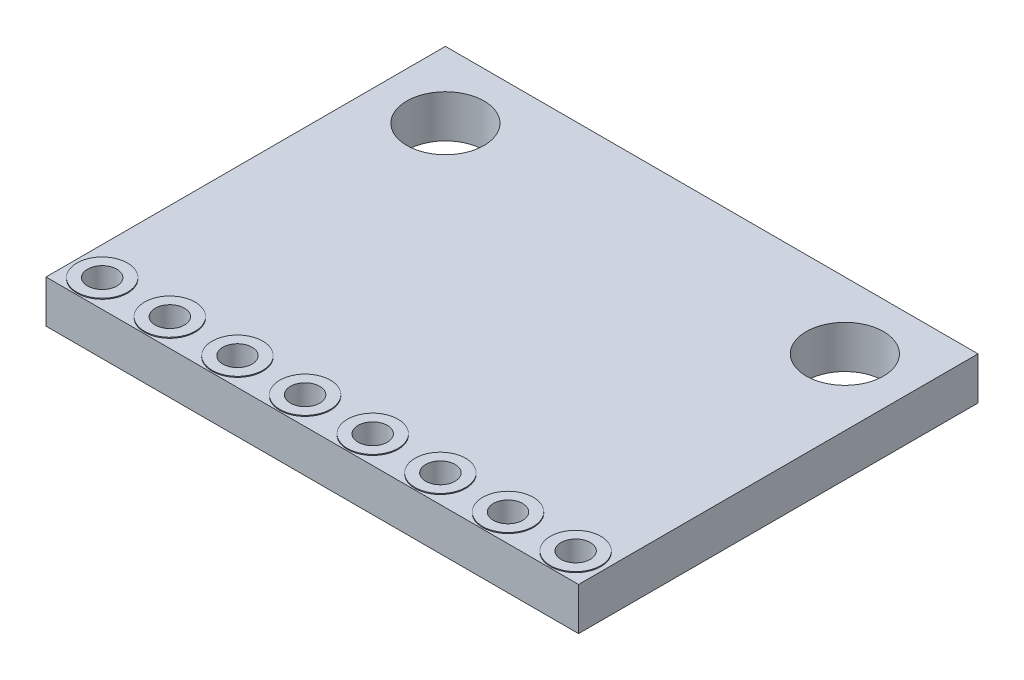
ISO-10303-21;
HEADER;
FILE_DESCRIPTION(('STEP AP214'),'2;1');
FILE_NAME('part.step','',(''),(''),'','','');
FILE_SCHEMA(('AUTOMOTIVE_DESIGN { 1 0 10303 214 1 1 1 1 }'));
ENDSEC;
DATA;
#1=APPLICATION_CONTEXT('core data for automotive mechanical design processes');
#2=APPLICATION_PROTOCOL_DEFINITION('international standard','automotive_design',2000,#1);
#3=PRODUCT_CONTEXT('',#1,'mechanical');
#4=PRODUCT('Part','Part','',(#3));
#5=PRODUCT_RELATED_PRODUCT_CATEGORY('part','',(#4));
#6=PRODUCT_DEFINITION_FORMATION('','',#4);
#7=PRODUCT_DEFINITION_CONTEXT('part definition',#1,'design');
#8=PRODUCT_DEFINITION('design','',#6,#7);
#9=PRODUCT_DEFINITION_SHAPE('','',#8);
#10=(LENGTH_UNIT() NAMED_UNIT(*) SI_UNIT(.MILLI.,.METRE.));
#11=(NAMED_UNIT(*) PLANE_ANGLE_UNIT() SI_UNIT($,.RADIAN.));
#12=(NAMED_UNIT(*) SI_UNIT($,.STERADIAN.) SOLID_ANGLE_UNIT());
#13=UNCERTAINTY_MEASURE_WITH_UNIT(LENGTH_MEASURE(1.E-05),#10,'distance_accuracy_value','');
#14=(GEOMETRIC_REPRESENTATION_CONTEXT(3) GLOBAL_UNCERTAINTY_ASSIGNED_CONTEXT((#13)) GLOBAL_UNIT_ASSIGNED_CONTEXT((#10,
#11,#12)) REPRESENTATION_CONTEXT('',''));
#15=CARTESIAN_POINT('',(0.,0.,0.));
#16=DIRECTION('',(0.,0.,1.));
#17=DIRECTION('',(1.,0.,0.));
#18=AXIS2_PLACEMENT_3D('',#15,#16,#17);
#19=CARTESIAN_POINT('',(0.,0.,0.));
#20=DIRECTION('',(0.,1.,0.));
#21=DIRECTION('',(0.,0.,1.));
#22=AXIS2_PLACEMENT_3D('',#19,#20,#21);
#23=PLANE('',#22);
#24=CARTESIAN_POINT('',(-6.35,0.,6.49999999999989));
#25=DIRECTION('',(0.,1.,0.));
#26=DIRECTION('',(0.,0.,1.));
#27=AXIS2_PLACEMENT_3D('',#24,#25,#26);
#28=CIRCLE('',#27,0.95);
#29=CARTESIAN_POINT('',(-6.35,0.,7.44999999999989));
#30=VERTEX_POINT('',#29);
#31=EDGE_CURVE('E41',#30,#30,#28,.F.);
#32=ORIENTED_EDGE('',*,*,#31,.F.);
#33=EDGE_LOOP('',(#32));
#34=FACE_BOUND('',#33,.T.);
#35=CARTESIAN_POINT('',(-1.27,0.,6.49999999999993));
#36=DIRECTION('',(0.,1.,0.));
#37=DIRECTION('',(0.,0.,1.));
#38=AXIS2_PLACEMENT_3D('',#35,#36,#37);
#39=CIRCLE('',#38,0.95);
#40=CARTESIAN_POINT('',(-1.27,0.,7.44999999999993));
#41=VERTEX_POINT('',#40);
#42=EDGE_CURVE('E123',#41,#41,#39,.F.);
#43=ORIENTED_EDGE('',*,*,#42,.F.);
#44=EDGE_LOOP('',(#43));
#45=FACE_BOUND('',#44,.T.);
#46=CARTESIAN_POINT('',(3.81,0.,6.49999999999996));
#47=DIRECTION('',(0.,1.,0.));
#48=DIRECTION('',(0.,0.,1.));
#49=AXIS2_PLACEMENT_3D('',#46,#47,#48);
#50=CIRCLE('',#49,0.95);
#51=CARTESIAN_POINT('',(3.81,0.,7.44999999999996));
#52=VERTEX_POINT('',#51);
#53=EDGE_CURVE('E117',#52,#52,#50,.F.);
#54=ORIENTED_EDGE('',*,*,#53,.F.);
#55=EDGE_LOOP('',(#54));
#56=FACE_BOUND('',#55,.T.);
#57=CARTESIAN_POINT('',(8.89,0.,6.5));
#58=DIRECTION('',(0.,1.,0.));
#59=DIRECTION('',(0.,0.,1.));
#60=AXIS2_PLACEMENT_3D('',#57,#58,#59);
#61=CIRCLE('',#60,0.95);
#62=CARTESIAN_POINT('',(8.89,0.,7.45));
#63=VERTEX_POINT('',#62);
#64=EDGE_CURVE('E111',#63,#63,#61,.F.);
#65=ORIENTED_EDGE('',*,*,#64,.F.);
#66=EDGE_LOOP('',(#65));
#67=FACE_BOUND('',#66,.T.);
#68=DIRECTION('',(0.,0.,-1.));
#69=VECTOR('',#68,1.);
#70=CARTESIAN_POINT('',(10.,0.,-7.5));
#71=LINE('',#70,#69);
#72=CARTESIAN_POINT('',(10.,0.,7.5));
#73=VERTEX_POINT('',#72);
#74=CARTESIAN_POINT('',(10.,0.,-7.5));
#75=VERTEX_POINT('',#74);
#76=EDGE_CURVE('E101',#73,#75,#71,.T.);
#77=ORIENTED_EDGE('',*,*,#76,.F.);
#78=DIRECTION('',(1.,0.,0.));
#79=VECTOR('',#78,1.);
#80=CARTESIAN_POINT('',(-10.,0.,7.5));
#81=LINE('',#80,#79);
#82=CARTESIAN_POINT('',(-10.,0.,7.5));
#83=VERTEX_POINT('',#82);
#84=EDGE_CURVE('E72',#83,#73,#81,.T.);
#85=ORIENTED_EDGE('',*,*,#84,.F.);
#86=DIRECTION('',(0.,0.,1.));
#87=VECTOR('',#86,1.);
#88=CARTESIAN_POINT('',(-10.,0.,-7.5));
#89=LINE('',#88,#87);
#90=CARTESIAN_POINT('',(-10.,0.,-7.5));
#91=VERTEX_POINT('',#90);
#92=EDGE_CURVE('E66',#91,#83,#89,.T.);
#93=ORIENTED_EDGE('',*,*,#92,.F.);
#94=DIRECTION('',(-1.,0.,0.));
#95=VECTOR('',#94,1.);
#96=CARTESIAN_POINT('',(-10.,0.,-7.5));
#97=LINE('',#96,#95);
#98=EDGE_CURVE('E91',#75,#91,#97,.T.);
#99=ORIENTED_EDGE('',*,*,#98,.F.);
#100=EDGE_LOOP('',(#77,#85,#93,#99));
#101=FACE_BOUND('',#100,.T.);
#102=CARTESIAN_POINT('',(-7.5,0.,-5.));
#103=DIRECTION('',(0.,1.,0.));
#104=DIRECTION('',(0.,0.,1.));
#105=AXIS2_PLACEMENT_3D('',#102,#103,#104);
#106=CIRCLE('',#105,1.45);
#107=CARTESIAN_POINT('',(-7.5,0.,-3.55));
#108=VERTEX_POINT('',#107);
#109=EDGE_CURVE('E147',#108,#108,#106,.T.);
#110=ORIENTED_EDGE('',*,*,#109,.T.);
#111=EDGE_LOOP('',(#110));
#112=FACE_BOUND('',#111,.T.);
#113=CARTESIAN_POINT('',(7.5,0.,-5.));
#114=DIRECTION('',(0.,1.,0.));
#115=DIRECTION('',(0.,0.,-1.));
#116=AXIS2_PLACEMENT_3D('',#113,#114,#115);
#117=CIRCLE('',#116,1.45);
#118=CARTESIAN_POINT('',(7.5,0.,-6.45));
#119=VERTEX_POINT('',#118);
#120=EDGE_CURVE('E151',#119,#119,#117,.T.);
#121=ORIENTED_EDGE('',*,*,#120,.T.);
#122=EDGE_LOOP('',(#121));
#123=FACE_BOUND('',#122,.T.);
#124=CARTESIAN_POINT('',(6.35,0.,6.49999999999998));
#125=DIRECTION('',(0.,1.,0.));
#126=DIRECTION('',(0.,0.,1.));
#127=AXIS2_PLACEMENT_3D('',#124,#125,#126);
#128=CIRCLE('',#127,0.95);
#129=CARTESIAN_POINT('',(6.35,0.,7.44999999999998));
#130=VERTEX_POINT('',#129);
#131=EDGE_CURVE('E114',#130,#130,#128,.F.);
#132=ORIENTED_EDGE('',*,*,#131,.F.);
#133=EDGE_LOOP('',(#132));
#134=FACE_BOUND('',#133,.T.);
#135=CARTESIAN_POINT('',(1.27,0.,6.49999999999995));
#136=DIRECTION('',(0.,1.,0.));
#137=DIRECTION('',(0.,0.,1.));
#138=AXIS2_PLACEMENT_3D('',#135,#136,#137);
#139=CIRCLE('',#138,0.95);
#140=CARTESIAN_POINT('',(1.27,0.,7.44999999999995));
#141=VERTEX_POINT('',#140);
#142=EDGE_CURVE('E120',#141,#141,#139,.F.);
#143=ORIENTED_EDGE('',*,*,#142,.F.);
#144=EDGE_LOOP('',(#143));
#145=FACE_BOUND('',#144,.T.);
#146=CARTESIAN_POINT('',(-3.81,0.,6.49999999999991));
#147=DIRECTION('',(0.,1.,0.));
#148=DIRECTION('',(0.,0.,1.));
#149=AXIS2_PLACEMENT_3D('',#146,#147,#148);
#150=CIRCLE('',#149,0.95);
#151=CARTESIAN_POINT('',(-3.81,0.,7.44999999999991));
#152=VERTEX_POINT('',#151);
#153=EDGE_CURVE('E126',#152,#152,#150,.F.);
#154=ORIENTED_EDGE('',*,*,#153,.F.);
#155=EDGE_LOOP('',(#154));
#156=FACE_BOUND('',#155,.T.);
#157=CARTESIAN_POINT('',(-8.89,0.,6.49999999999988));
#158=DIRECTION('',(0.,1.,0.));
#159=DIRECTION('',(0.,0.,1.));
#160=AXIS2_PLACEMENT_3D('',#157,#158,#159);
#161=CIRCLE('',#160,0.95);
#162=CARTESIAN_POINT('',(-8.89,0.,7.44999999999987));
#163=VERTEX_POINT('',#162);
#164=EDGE_CURVE('E11',#163,#163,#161,.F.);
#165=ORIENTED_EDGE('',*,*,#164,.F.);
#166=EDGE_LOOP('',(#165));
#167=FACE_BOUND('',#166,.T.);
#168=ADVANCED_FACE('F32',(#34,#45,#56,#67,#101,#112,#123,#134,#145,#156,#167),#23,.F.);
#169=CARTESIAN_POINT('',(0.,1.6,0.));
#170=DIRECTION('',(0.,1.,0.));
#171=DIRECTION('',(0.,0.,1.));
#172=AXIS2_PLACEMENT_3D('',#169,#170,#171);
#173=PLANE('',#172);
#174=CARTESIAN_POINT('',(8.89,1.6,6.50000000000005));
#175=DIRECTION('',(0.,1.,0.));
#176=DIRECTION('',(0.,0.,1.));
#177=AXIS2_PLACEMENT_3D('',#174,#175,#176);
#178=CIRCLE('',#177,0.949999999999999);
#179=CARTESIAN_POINT('',(8.89,1.6,7.45000000000005));
#180=VERTEX_POINT('',#179);
#181=EDGE_CURVE('E408',#180,#180,#178,.T.);
#182=ORIENTED_EDGE('',*,*,#181,.F.);
#183=EDGE_LOOP('',(#182));
#184=FACE_BOUND('',#183,.T.);
#185=CARTESIAN_POINT('',(3.81,1.6,6.50000000000005));
#186=DIRECTION('',(0.,1.,0.));
#187=DIRECTION('',(0.,0.,1.));
#188=AXIS2_PLACEMENT_3D('',#185,#186,#187);
#189=CIRCLE('',#188,0.949999999999999);
#190=CARTESIAN_POINT('',(3.81,1.6,7.45000000000005));
#191=VERTEX_POINT('',#190);
#192=EDGE_CURVE('E390',#191,#191,#189,.T.);
#193=ORIENTED_EDGE('',*,*,#192,.F.);
#194=EDGE_LOOP('',(#193));
#195=FACE_BOUND('',#194,.T.);
#196=CARTESIAN_POINT('',(-1.27,1.6,6.50000000000005));
#197=DIRECTION('',(0.,1.,0.));
#198=DIRECTION('',(0.,0.,1.));
#199=AXIS2_PLACEMENT_3D('',#196,#197,#198);
#200=CIRCLE('',#199,0.949999999999999);
#201=CARTESIAN_POINT('',(-1.27,1.6,7.45000000000005));
#202=VERTEX_POINT('',#201);
#203=EDGE_CURVE('E372',#202,#202,#200,.T.);
#204=ORIENTED_EDGE('',*,*,#203,.F.);
#205=EDGE_LOOP('',(#204));
#206=FACE_BOUND('',#205,.T.);
#207=CARTESIAN_POINT('',(-6.35,1.6,6.50000000000005));
#208=DIRECTION('',(0.,1.,0.));
#209=DIRECTION('',(0.,0.,1.));
#210=AXIS2_PLACEMENT_3D('',#207,#208,#209);
#211=CIRCLE('',#210,0.949999999999999);
#212=CARTESIAN_POINT('',(-6.35,1.6,7.45000000000005));
#213=VERTEX_POINT('',#212);
#214=EDGE_CURVE('E354',#213,#213,#211,.T.);
#215=ORIENTED_EDGE('',*,*,#214,.F.);
#216=EDGE_LOOP('',(#215));
#217=FACE_BOUND('',#216,.T.);
#218=CARTESIAN_POINT('',(-7.5,1.6,-5.));
#219=DIRECTION('',(0.,1.,0.));
#220=DIRECTION('',(0.,0.,1.));
#221=AXIS2_PLACEMENT_3D('',#218,#219,#220);
#222=CIRCLE('',#221,1.45);
#223=CARTESIAN_POINT('',(-7.5,1.6,-3.55));
#224=VERTEX_POINT('',#223);
#225=EDGE_CURVE('E104',#224,#224,#222,.T.);
#226=ORIENTED_EDGE('',*,*,#225,.F.);
#227=EDGE_LOOP('',(#226));
#228=FACE_BOUND('',#227,.T.);
#229=DIRECTION('',(0.,0.,-1.));
#230=VECTOR('',#229,1.);
#231=CARTESIAN_POINT('',(10.,1.6,-7.5));
#232=LINE('',#231,#230);
#233=CARTESIAN_POINT('',(10.,1.6,7.5));
#234=VERTEX_POINT('',#233);
#235=CARTESIAN_POINT('',(10.,1.6,-7.5));
#236=VERTEX_POINT('',#235);
#237=EDGE_CURVE('E86',#234,#236,#232,.T.);
#238=ORIENTED_EDGE('',*,*,#237,.T.);
#239=DIRECTION('',(-1.,0.,0.));
#240=VECTOR('',#239,1.);
#241=CARTESIAN_POINT('',(-10.,1.6,-7.5));
#242=LINE('',#241,#240);
#243=CARTESIAN_POINT('',(-10.,1.6,-7.5));
#244=VERTEX_POINT('',#243);
#245=EDGE_CURVE('E80',#236,#244,#242,.T.);
#246=ORIENTED_EDGE('',*,*,#245,.T.);
#247=DIRECTION('',(0.,0.,1.));
#248=VECTOR('',#247,1.);
#249=CARTESIAN_POINT('',(-10.,1.6,-7.5));
#250=LINE('',#249,#248);
#251=CARTESIAN_POINT('',(-10.,1.6,7.5));
#252=VERTEX_POINT('',#251);
#253=EDGE_CURVE('E84',#244,#252,#250,.T.);
#254=ORIENTED_EDGE('',*,*,#253,.T.);
#255=DIRECTION('',(1.,0.,0.));
#256=VECTOR('',#255,1.);
#257=CARTESIAN_POINT('',(-10.,1.6,7.5));
#258=LINE('',#257,#256);
#259=EDGE_CURVE('E49',#252,#234,#258,.T.);
#260=ORIENTED_EDGE('',*,*,#259,.T.);
#261=EDGE_LOOP('',(#238,#246,#254,#260));
#262=FACE_BOUND('',#261,.T.);
#263=CARTESIAN_POINT('',(7.5,1.6,-5.));
#264=DIRECTION('',(0.,1.,0.));
#265=DIRECTION('',(0.,0.,-1.));
#266=AXIS2_PLACEMENT_3D('',#263,#264,#265);
#267=CIRCLE('',#266,1.45);
#268=CARTESIAN_POINT('',(7.5,1.6,-6.45));
#269=VERTEX_POINT('',#268);
#270=EDGE_CURVE('E347',#269,#269,#267,.T.);
#271=ORIENTED_EDGE('',*,*,#270,.F.);
#272=EDGE_LOOP('',(#271));
#273=FACE_BOUND('',#272,.T.);
#274=CARTESIAN_POINT('',(-3.81,1.6,6.50000000000005));
#275=DIRECTION('',(0.,1.,0.));
#276=DIRECTION('',(0.,0.,1.));
#277=AXIS2_PLACEMENT_3D('',#274,#275,#276);
#278=CIRCLE('',#277,0.949999999999999);
#279=CARTESIAN_POINT('',(-3.81,1.6,7.45000000000005));
#280=VERTEX_POINT('',#279);
#281=EDGE_CURVE('E363',#280,#280,#278,.T.);
#282=ORIENTED_EDGE('',*,*,#281,.F.);
#283=EDGE_LOOP('',(#282));
#284=FACE_BOUND('',#283,.T.);
#285=CARTESIAN_POINT('',(1.27,1.6,6.50000000000005));
#286=DIRECTION('',(0.,1.,0.));
#287=DIRECTION('',(0.,0.,1.));
#288=AXIS2_PLACEMENT_3D('',#285,#286,#287);
#289=CIRCLE('',#288,0.949999999999999);
#290=CARTESIAN_POINT('',(1.27,1.6,7.45000000000005));
#291=VERTEX_POINT('',#290);
#292=EDGE_CURVE('E381',#291,#291,#289,.T.);
#293=ORIENTED_EDGE('',*,*,#292,.F.);
#294=EDGE_LOOP('',(#293));
#295=FACE_BOUND('',#294,.T.);
#296=CARTESIAN_POINT('',(6.35,1.6,6.50000000000005));
#297=DIRECTION('',(0.,1.,0.));
#298=DIRECTION('',(0.,0.,1.));
#299=AXIS2_PLACEMENT_3D('',#296,#297,#298);
#300=CIRCLE('',#299,0.949999999999999);
#301=CARTESIAN_POINT('',(6.35,1.6,7.45000000000005));
#302=VERTEX_POINT('',#301);
#303=EDGE_CURVE('E399',#302,#302,#300,.T.);
#304=ORIENTED_EDGE('',*,*,#303,.F.);
#305=EDGE_LOOP('',(#304));
#306=FACE_BOUND('',#305,.T.);
#307=CARTESIAN_POINT('',(-8.89,1.6,6.50000000000005));
#308=DIRECTION('',(0.,1.,0.));
#309=DIRECTION('',(0.,0.,1.));
#310=AXIS2_PLACEMENT_3D('',#307,#308,#309);
#311=CIRCLE('',#310,0.949999999999999);
#312=CARTESIAN_POINT('',(-8.89,1.6,7.45000000000005));
#313=VERTEX_POINT('',#312);
#314=EDGE_CURVE('E417',#313,#313,#311,.T.);
#315=ORIENTED_EDGE('',*,*,#314,.F.);
#316=EDGE_LOOP('',(#315));
#317=FACE_BOUND('',#316,.T.);
#318=ADVANCED_FACE('F81',(#184,#195,#206,#217,#228,#262,#273,#284,#295,#306,#317),#173,.T.);
#319=CARTESIAN_POINT('',(10.,1.6,-7.5));
#320=DIRECTION('',(-1.,0.,0.));
#321=DIRECTION('',(0.,0.,1.));
#322=AXIS2_PLACEMENT_3D('',#319,#320,#321);
#323=PLANE('',#322);
#324=ORIENTED_EDGE('',*,*,#76,.T.);
#325=DIRECTION('',(0.,-1.,0.));
#326=VECTOR('',#325,1.);
#327=CARTESIAN_POINT('',(10.,1.6,-7.5));
#328=LINE('',#327,#326);
#329=EDGE_CURVE('E92',#236,#75,#328,.T.);
#330=ORIENTED_EDGE('',*,*,#329,.F.);
#331=ORIENTED_EDGE('',*,*,#237,.F.);
#332=DIRECTION('',(0.,-1.,0.));
#333=VECTOR('',#332,1.);
#334=CARTESIAN_POINT('',(10.,1.6,7.5));
#335=LINE('',#334,#333);
#336=EDGE_CURVE('E97',#234,#73,#335,.T.);
#337=ORIENTED_EDGE('',*,*,#336,.T.);
#338=EDGE_LOOP('',(#324,#330,#331,#337));
#339=FACE_BOUND('',#338,.T.);
#340=ADVANCED_FACE('F34',(#339),#323,.F.);
#341=CARTESIAN_POINT('',(-10.,1.6,-7.5));
#342=DIRECTION('',(0.,0.,1.));
#343=DIRECTION('',(1.,0.,0.));
#344=AXIS2_PLACEMENT_3D('',#341,#342,#343);
#345=PLANE('',#344);
#346=ORIENTED_EDGE('',*,*,#98,.T.);
#347=DIRECTION('',(0.,-1.,0.));
#348=VECTOR('',#347,1.);
#349=CARTESIAN_POINT('',(-10.,1.6,-7.5));
#350=LINE('',#349,#348);
#351=EDGE_CURVE('E89',#244,#91,#350,.T.);
#352=ORIENTED_EDGE('',*,*,#351,.F.);
#353=ORIENTED_EDGE('',*,*,#245,.F.);
#354=ORIENTED_EDGE('',*,*,#329,.T.);
#355=EDGE_LOOP('',(#346,#352,#353,#354));
#356=FACE_BOUND('',#355,.T.);
#357=ADVANCED_FACE('F90',(#356),#345,.F.);
#358=CARTESIAN_POINT('',(-10.,1.6,-7.5));
#359=DIRECTION('',(1.,0.,0.));
#360=DIRECTION('',(0.,0.,-1.));
#361=AXIS2_PLACEMENT_3D('',#358,#359,#360);
#362=PLANE('',#361);
#363=ORIENTED_EDGE('',*,*,#92,.T.);
#364=DIRECTION('',(0.,-1.,0.));
#365=VECTOR('',#364,1.);
#366=CARTESIAN_POINT('',(-10.,1.6,7.5));
#367=LINE('',#366,#365);
#368=EDGE_CURVE('E93',#252,#83,#367,.T.);
#369=ORIENTED_EDGE('',*,*,#368,.F.);
#370=ORIENTED_EDGE('',*,*,#253,.F.);
#371=ORIENTED_EDGE('',*,*,#351,.T.);
#372=EDGE_LOOP('',(#363,#369,#370,#371));
#373=FACE_BOUND('',#372,.T.);
#374=ADVANCED_FACE('F95',(#373),#362,.F.);
#375=CARTESIAN_POINT('',(-10.,1.6,7.5));
#376=DIRECTION('',(0.,0.,-1.));
#377=DIRECTION('',(-1.,0.,0.));
#378=AXIS2_PLACEMENT_3D('',#375,#376,#377);
#379=PLANE('',#378);
#380=ORIENTED_EDGE('',*,*,#84,.T.);
#381=ORIENTED_EDGE('',*,*,#336,.F.);
#382=ORIENTED_EDGE('',*,*,#259,.F.);
#383=ORIENTED_EDGE('',*,*,#368,.T.);
#384=EDGE_LOOP('',(#380,#381,#382,#383));
#385=FACE_BOUND('',#384,.T.);
#386=ADVANCED_FACE('F330',(#385),#379,.F.);
#387=CARTESIAN_POINT('',(-7.5,1.6,-5.));
#388=DIRECTION('',(0.,-1.,0.));
#389=DIRECTION('',(0.,0.,-1.));
#390=AXIS2_PLACEMENT_3D('',#387,#388,#389);
#391=CYLINDRICAL_SURFACE('',#390,1.45);
#392=ORIENTED_EDGE('',*,*,#225,.T.);
#393=EDGE_LOOP('',(#392));
#394=FACE_BOUND('',#393,.T.);
#395=ORIENTED_EDGE('',*,*,#109,.F.);
#396=EDGE_LOOP('',(#395));
#397=FACE_BOUND('',#396,.T.);
#398=ADVANCED_FACE('F326',(#394,#397),#391,.F.);
#399=CARTESIAN_POINT('',(7.5,1.6,-5.));
#400=DIRECTION('',(0.,-1.,0.));
#401=DIRECTION('',(0.,0.,-1.));
#402=AXIS2_PLACEMENT_3D('',#399,#400,#401);
#403=CYLINDRICAL_SURFACE('',#402,1.45);
#404=ORIENTED_EDGE('',*,*,#270,.T.);
#405=EDGE_LOOP('',(#404));
#406=FACE_BOUND('',#405,.T.);
#407=ORIENTED_EDGE('',*,*,#120,.F.);
#408=EDGE_LOOP('',(#407));
#409=FACE_BOUND('',#408,.T.);
#410=ADVANCED_FACE('F322',(#406,#409),#403,.F.);
#411=CARTESIAN_POINT('',(-1.27,1.6,6.5));
#412=DIRECTION('',(0.,-1.,0.));
#413=DIRECTION('',(0.,0.,-1.));
#414=AXIS2_PLACEMENT_3D('',#411,#412,#413);
#415=CYLINDRICAL_SURFACE('',#414,0.55);
#416=CARTESIAN_POINT('',(-1.27,1.635,6.50000000000005));
#417=DIRECTION('',(0.,1.,0.));
#418=DIRECTION('',(0.,0.,1.));
#419=AXIS2_PLACEMENT_3D('',#416,#417,#418);
#420=CIRCLE('',#419,0.55);
#421=CARTESIAN_POINT('',(-1.27,1.635,7.05000000000005));
#422=VERTEX_POINT('',#421);
#423=EDGE_CURVE('E375',#422,#422,#420,.T.);
#424=ORIENTED_EDGE('',*,*,#423,.T.);
#425=EDGE_LOOP('',(#424));
#426=FACE_BOUND('',#425,.T.);
#427=CARTESIAN_POINT('',(-1.27,-0.035,6.49999999999993));
#428=DIRECTION('',(0.,-1.,0.));
#429=DIRECTION('',(0.,0.,-1.));
#430=AXIS2_PLACEMENT_3D('',#427,#428,#429);
#431=CIRCLE('',#430,0.55);
#432=CARTESIAN_POINT('',(-1.27,-0.035,5.94999999999993));
#433=VERTEX_POINT('',#432);
#434=EDGE_CURVE('E452',#433,#433,#431,.T.);
#435=ORIENTED_EDGE('',*,*,#434,.T.);
#436=EDGE_LOOP('',(#435));
#437=FACE_BOUND('',#436,.T.);
#438=ADVANCED_FACE('F318',(#426,#437),#415,.F.);
#439=CARTESIAN_POINT('',(-3.81,1.6,6.50000000000002));
#440=DIRECTION('',(0.,-1.,0.));
#441=DIRECTION('',(0.,0.,-1.));
#442=AXIS2_PLACEMENT_3D('',#439,#440,#441);
#443=CYLINDRICAL_SURFACE('',#442,0.55);
#444=CARTESIAN_POINT('',(-3.81,1.635,6.50000000000005));
#445=DIRECTION('',(0.,1.,0.));
#446=DIRECTION('',(0.,0.,1.));
#447=AXIS2_PLACEMENT_3D('',#444,#445,#446);
#448=CIRCLE('',#447,0.55);
#449=CARTESIAN_POINT('',(-3.81,1.635,7.05000000000005));
#450=VERTEX_POINT('',#449);
#451=EDGE_CURVE('E366',#450,#450,#448,.T.);
#452=ORIENTED_EDGE('',*,*,#451,.T.);
#453=EDGE_LOOP('',(#452));
#454=FACE_BOUND('',#453,.T.);
#455=CARTESIAN_POINT('',(-3.81,-0.035,6.49999999999991));
#456=DIRECTION('',(0.,-1.,0.));
#457=DIRECTION('',(0.,0.,-1.));
#458=AXIS2_PLACEMENT_3D('',#455,#456,#457);
#459=CIRCLE('',#458,0.55);
#460=CARTESIAN_POINT('',(-3.81,-0.035,5.94999999999991));
#461=VERTEX_POINT('',#460);
#462=EDGE_CURVE('E458',#461,#461,#459,.T.);
#463=ORIENTED_EDGE('',*,*,#462,.T.);
#464=EDGE_LOOP('',(#463));
#465=FACE_BOUND('',#464,.T.);
#466=ADVANCED_FACE('F314',(#454,#465),#443,.F.);
#467=CARTESIAN_POINT('',(-6.35,1.6,6.50000000000004));
#468=DIRECTION('',(0.,-1.,0.));
#469=DIRECTION('',(0.,0.,-1.));
#470=AXIS2_PLACEMENT_3D('',#467,#468,#469);
#471=CYLINDRICAL_SURFACE('',#470,0.55);
#472=CARTESIAN_POINT('',(-6.35,1.635,6.50000000000005));
#473=DIRECTION('',(0.,1.,0.));
#474=DIRECTION('',(0.,0.,1.));
#475=AXIS2_PLACEMENT_3D('',#472,#473,#474);
#476=CIRCLE('',#475,0.55);
#477=CARTESIAN_POINT('',(-6.35,1.635,7.05000000000005));
#478=VERTEX_POINT('',#477);
#479=EDGE_CURVE('E357',#478,#478,#476,.T.);
#480=ORIENTED_EDGE('',*,*,#479,.T.);
#481=EDGE_LOOP('',(#480));
#482=FACE_BOUND('',#481,.T.);
#483=CARTESIAN_POINT('',(-6.35,-0.035,6.49999999999989));
#484=DIRECTION('',(0.,-1.,0.));
#485=DIRECTION('',(0.,0.,-1.));
#486=AXIS2_PLACEMENT_3D('',#483,#484,#485);
#487=CIRCLE('',#486,0.55);
#488=CARTESIAN_POINT('',(-6.35,-0.035,5.94999999999989));
#489=VERTEX_POINT('',#488);
#490=EDGE_CURVE('E464',#489,#489,#487,.T.);
#491=ORIENTED_EDGE('',*,*,#490,.T.);
#492=EDGE_LOOP('',(#491));
#493=FACE_BOUND('',#492,.T.);
#494=ADVANCED_FACE('F310',(#482,#493),#471,.F.);
#495=CARTESIAN_POINT('',(-8.89,1.6,6.50000000000005));
#496=DIRECTION('',(0.,-1.,0.));
#497=DIRECTION('',(0.,0.,-1.));
#498=AXIS2_PLACEMENT_3D('',#495,#496,#497);
#499=CYLINDRICAL_SURFACE('',#498,0.55);
#500=CARTESIAN_POINT('',(-8.89,1.635,6.50000000000005));
#501=DIRECTION('',(0.,1.,0.));
#502=DIRECTION('',(0.,0.,1.));
#503=AXIS2_PLACEMENT_3D('',#500,#501,#502);
#504=CIRCLE('',#503,0.55);
#505=CARTESIAN_POINT('',(-8.89,1.635,7.05000000000005));
#506=VERTEX_POINT('',#505);
#507=EDGE_CURVE('E420',#506,#506,#504,.T.);
#508=ORIENTED_EDGE('',*,*,#507,.T.);
#509=EDGE_LOOP('',(#508));
#510=FACE_BOUND('',#509,.T.);
#511=CARTESIAN_POINT('',(-8.89,-0.035,6.49999999999988));
#512=DIRECTION('',(0.,-1.,0.));
#513=DIRECTION('',(0.,0.,-1.));
#514=AXIS2_PLACEMENT_3D('',#511,#512,#513);
#515=CIRCLE('',#514,0.55);
#516=CARTESIAN_POINT('',(-8.89,-0.035,5.94999999999988));
#517=VERTEX_POINT('',#516);
#518=EDGE_CURVE('E470',#517,#517,#515,.T.);
#519=ORIENTED_EDGE('',*,*,#518,.T.);
#520=EDGE_LOOP('',(#519));
#521=FACE_BOUND('',#520,.T.);
#522=ADVANCED_FACE('F306',(#510,#521),#499,.F.);
#523=CARTESIAN_POINT('',(1.27,1.6,6.5));
#524=DIRECTION('',(0.,-1.,0.));
#525=DIRECTION('',(0.,0.,-1.));
#526=AXIS2_PLACEMENT_3D('',#523,#524,#525);
#527=CYLINDRICAL_SURFACE('',#526,0.55);
#528=CARTESIAN_POINT('',(1.27,1.635,6.50000000000005));
#529=DIRECTION('',(0.,1.,0.));
#530=DIRECTION('',(0.,0.,1.));
#531=AXIS2_PLACEMENT_3D('',#528,#529,#530);
#532=CIRCLE('',#531,0.55);
#533=CARTESIAN_POINT('',(1.27,1.635,7.05000000000005));
#534=VERTEX_POINT('',#533);
#535=EDGE_CURVE('E384',#534,#534,#532,.T.);
#536=ORIENTED_EDGE('',*,*,#535,.T.);
#537=EDGE_LOOP('',(#536));
#538=FACE_BOUND('',#537,.T.);
#539=CARTESIAN_POINT('',(1.27,-0.035,6.49999999999995));
#540=DIRECTION('',(0.,-1.,0.));
#541=DIRECTION('',(0.,0.,-1.));
#542=AXIS2_PLACEMENT_3D('',#539,#540,#541);
#543=CIRCLE('',#542,0.55);
#544=CARTESIAN_POINT('',(1.27,-0.035,5.94999999999995));
#545=VERTEX_POINT('',#544);
#546=EDGE_CURVE('E446',#545,#545,#543,.T.);
#547=ORIENTED_EDGE('',*,*,#546,.T.);
#548=EDGE_LOOP('',(#547));
#549=FACE_BOUND('',#548,.T.);
#550=ADVANCED_FACE('F302',(#538,#549),#527,.F.);
#551=CARTESIAN_POINT('',(3.81,1.6,6.5));
#552=DIRECTION('',(0.,-1.,0.));
#553=DIRECTION('',(0.,0.,-1.));
#554=AXIS2_PLACEMENT_3D('',#551,#552,#553);
#555=CYLINDRICAL_SURFACE('',#554,0.55);
#556=CARTESIAN_POINT('',(3.81,1.635,6.50000000000005));
#557=DIRECTION('',(0.,1.,0.));
#558=DIRECTION('',(0.,0.,1.));
#559=AXIS2_PLACEMENT_3D('',#556,#557,#558);
#560=CIRCLE('',#559,0.55);
#561=CARTESIAN_POINT('',(3.81,1.635,7.05000000000005));
#562=VERTEX_POINT('',#561);
#563=EDGE_CURVE('E393',#562,#562,#560,.T.);
#564=ORIENTED_EDGE('',*,*,#563,.T.);
#565=EDGE_LOOP('',(#564));
#566=FACE_BOUND('',#565,.T.);
#567=CARTESIAN_POINT('',(3.81,-0.035,6.49999999999996));
#568=DIRECTION('',(0.,-1.,0.));
#569=DIRECTION('',(0.,0.,-1.));
#570=AXIS2_PLACEMENT_3D('',#567,#568,#569);
#571=CIRCLE('',#570,0.55);
#572=CARTESIAN_POINT('',(3.81,-0.035,5.94999999999996));
#573=VERTEX_POINT('',#572);
#574=EDGE_CURVE('E440',#573,#573,#571,.T.);
#575=ORIENTED_EDGE('',*,*,#574,.T.);
#576=EDGE_LOOP('',(#575));
#577=FACE_BOUND('',#576,.T.);
#578=ADVANCED_FACE('F298',(#566,#577),#555,.F.);
#579=CARTESIAN_POINT('',(6.35,1.6,6.5));
#580=DIRECTION('',(0.,-1.,0.));
#581=DIRECTION('',(0.,0.,-1.));
#582=AXIS2_PLACEMENT_3D('',#579,#580,#581);
#583=CYLINDRICAL_SURFACE('',#582,0.55);
#584=CARTESIAN_POINT('',(6.35,1.635,6.50000000000005));
#585=DIRECTION('',(0.,1.,0.));
#586=DIRECTION('',(0.,0.,1.));
#587=AXIS2_PLACEMENT_3D('',#584,#585,#586);
#588=CIRCLE('',#587,0.55);
#589=CARTESIAN_POINT('',(6.35,1.635,7.05000000000005));
#590=VERTEX_POINT('',#589);
#591=EDGE_CURVE('E402',#590,#590,#588,.T.);
#592=ORIENTED_EDGE('',*,*,#591,.T.);
#593=EDGE_LOOP('',(#592));
#594=FACE_BOUND('',#593,.T.);
#595=CARTESIAN_POINT('',(6.35,-0.035,6.49999999999998));
#596=DIRECTION('',(0.,-1.,0.));
#597=DIRECTION('',(0.,0.,-1.));
#598=AXIS2_PLACEMENT_3D('',#595,#596,#597);
#599=CIRCLE('',#598,0.55);
#600=CARTESIAN_POINT('',(6.35,-0.035,5.94999999999998));
#601=VERTEX_POINT('',#600);
#602=EDGE_CURVE('E434',#601,#601,#599,.T.);
#603=ORIENTED_EDGE('',*,*,#602,.T.);
#604=EDGE_LOOP('',(#603));
#605=FACE_BOUND('',#604,.T.);
#606=ADVANCED_FACE('F294',(#594,#605),#583,.F.);
#607=CARTESIAN_POINT('',(8.89,1.6,6.5));
#608=DIRECTION('',(0.,-1.,0.));
#609=DIRECTION('',(0.,0.,-1.));
#610=AXIS2_PLACEMENT_3D('',#607,#608,#609);
#611=CYLINDRICAL_SURFACE('',#610,0.55);
#612=CARTESIAN_POINT('',(8.89,1.635,6.50000000000005));
#613=DIRECTION('',(0.,1.,0.));
#614=DIRECTION('',(0.,0.,1.));
#615=AXIS2_PLACEMENT_3D('',#612,#613,#614);
#616=CIRCLE('',#615,0.55);
#617=CARTESIAN_POINT('',(8.89,1.635,7.05000000000005));
#618=VERTEX_POINT('',#617);
#619=EDGE_CURVE('E411',#618,#618,#616,.T.);
#620=ORIENTED_EDGE('',*,*,#619,.T.);
#621=EDGE_LOOP('',(#620));
#622=FACE_BOUND('',#621,.T.);
#623=CARTESIAN_POINT('',(8.89,-0.035,6.5));
#624=DIRECTION('',(0.,-1.,0.));
#625=DIRECTION('',(0.,0.,-1.));
#626=AXIS2_PLACEMENT_3D('',#623,#624,#625);
#627=CIRCLE('',#626,0.55);
#628=CARTESIAN_POINT('',(8.89,-0.035,5.95));
#629=VERTEX_POINT('',#628);
#630=EDGE_CURVE('E428',#629,#629,#627,.T.);
#631=ORIENTED_EDGE('',*,*,#630,.T.);
#632=EDGE_LOOP('',(#631));
#633=FACE_BOUND('',#632,.T.);
#634=ADVANCED_FACE('F287',(#622,#633),#611,.F.);
#635=CARTESIAN_POINT('',(-6.35,1.635,6.50000000000005));
#636=DIRECTION('',(0.,1.,0.));
#637=DIRECTION('',(0.,0.,1.));
#638=AXIS2_PLACEMENT_3D('',#635,#636,#637);
#639=PLANE('',#638);
#640=CARTESIAN_POINT('',(-6.35,1.635,6.50000000000005));
#641=DIRECTION('',(0.,1.,0.));
#642=DIRECTION('',(0.,0.,1.));
#643=AXIS2_PLACEMENT_3D('',#640,#641,#642);
#644=CIRCLE('',#643,0.949999999999999);
#645=CARTESIAN_POINT('',(-6.35,1.635,7.45000000000005));
#646=VERTEX_POINT('',#645);
#647=EDGE_CURVE('E351',#646,#646,#644,.T.);
#648=ORIENTED_EDGE('',*,*,#647,.T.);
#649=EDGE_LOOP('',(#648));
#650=FACE_BOUND('',#649,.T.);
#651=ORIENTED_EDGE('',*,*,#479,.F.);
#652=EDGE_LOOP('',(#651));
#653=FACE_BOUND('',#652,.T.);
#654=ADVANCED_FACE('F284',(#650,#653),#639,.T.);
#655=CARTESIAN_POINT('',(-6.35,1.635,6.50000000000005));
#656=DIRECTION('',(0.,-1.,0.));
#657=DIRECTION('',(0.,0.,-1.));
#658=AXIS2_PLACEMENT_3D('',#655,#656,#657);
#659=CYLINDRICAL_SURFACE('',#658,0.949999999999999);
#660=ORIENTED_EDGE('',*,*,#647,.F.);
#661=EDGE_LOOP('',(#660));
#662=FACE_BOUND('',#661,.T.);
#663=ORIENTED_EDGE('',*,*,#214,.T.);
#664=EDGE_LOOP('',(#663));
#665=FACE_BOUND('',#664,.T.);
#666=ADVANCED_FACE('F279',(#662,#665),#659,.T.);
#667=CARTESIAN_POINT('',(-3.81,1.635,6.50000000000005));
#668=DIRECTION('',(0.,1.,0.));
#669=DIRECTION('',(0.,0.,1.));
#670=AXIS2_PLACEMENT_3D('',#667,#668,#669);
#671=PLANE('',#670);
#672=CARTESIAN_POINT('',(-3.81,1.635,6.50000000000005));
#673=DIRECTION('',(0.,1.,0.));
#674=DIRECTION('',(0.,0.,1.));
#675=AXIS2_PLACEMENT_3D('',#672,#673,#674);
#676=CIRCLE('',#675,0.949999999999999);
#677=CARTESIAN_POINT('',(-3.81,1.635,7.45000000000005));
#678=VERTEX_POINT('',#677);
#679=EDGE_CURVE('E362',#678,#678,#676,.T.);
#680=ORIENTED_EDGE('',*,*,#679,.T.);
#681=EDGE_LOOP('',(#680));
#682=FACE_BOUND('',#681,.T.);
#683=ORIENTED_EDGE('',*,*,#451,.F.);
#684=EDGE_LOOP('',(#683));
#685=FACE_BOUND('',#684,.T.);
#686=ADVANCED_FACE('F276',(#682,#685),#671,.T.);
#687=CARTESIAN_POINT('',(-3.81,1.635,6.50000000000005));
#688=DIRECTION('',(0.,-1.,0.));
#689=DIRECTION('',(0.,0.,-1.));
#690=AXIS2_PLACEMENT_3D('',#687,#688,#689);
#691=CYLINDRICAL_SURFACE('',#690,0.949999999999999);
#692=ORIENTED_EDGE('',*,*,#679,.F.);
#693=EDGE_LOOP('',(#692));
#694=FACE_BOUND('',#693,.T.);
#695=ORIENTED_EDGE('',*,*,#281,.T.);
#696=EDGE_LOOP('',(#695));
#697=FACE_BOUND('',#696,.T.);
#698=ADVANCED_FACE('F271',(#694,#697),#691,.T.);
#699=CARTESIAN_POINT('',(-1.27,1.635,6.50000000000005));
#700=DIRECTION('',(0.,1.,0.));
#701=DIRECTION('',(0.,0.,1.));
#702=AXIS2_PLACEMENT_3D('',#699,#700,#701);
#703=PLANE('',#702);
#704=CARTESIAN_POINT('',(-1.27,1.635,6.50000000000005));
#705=DIRECTION('',(0.,1.,0.));
#706=DIRECTION('',(0.,0.,1.));
#707=AXIS2_PLACEMENT_3D('',#704,#705,#706);
#708=CIRCLE('',#707,0.949999999999999);
#709=CARTESIAN_POINT('',(-1.27,1.635,7.45000000000005));
#710=VERTEX_POINT('',#709);
#711=EDGE_CURVE('E371',#710,#710,#708,.T.);
#712=ORIENTED_EDGE('',*,*,#711,.T.);
#713=EDGE_LOOP('',(#712));
#714=FACE_BOUND('',#713,.T.);
#715=ORIENTED_EDGE('',*,*,#423,.F.);
#716=EDGE_LOOP('',(#715));
#717=FACE_BOUND('',#716,.T.);
#718=ADVANCED_FACE('F268',(#714,#717),#703,.T.);
#719=CARTESIAN_POINT('',(-1.27,1.635,6.50000000000005));
#720=DIRECTION('',(0.,-1.,0.));
#721=DIRECTION('',(0.,0.,-1.));
#722=AXIS2_PLACEMENT_3D('',#719,#720,#721);
#723=CYLINDRICAL_SURFACE('',#722,0.949999999999999);
#724=ORIENTED_EDGE('',*,*,#711,.F.);
#725=EDGE_LOOP('',(#724));
#726=FACE_BOUND('',#725,.T.);
#727=ORIENTED_EDGE('',*,*,#203,.T.);
#728=EDGE_LOOP('',(#727));
#729=FACE_BOUND('',#728,.T.);
#730=ADVANCED_FACE('F263',(#726,#729),#723,.T.);
#731=CARTESIAN_POINT('',(1.27,1.635,6.50000000000005));
#732=DIRECTION('',(0.,1.,0.));
#733=DIRECTION('',(0.,0.,1.));
#734=AXIS2_PLACEMENT_3D('',#731,#732,#733);
#735=PLANE('',#734);
#736=CARTESIAN_POINT('',(1.27,1.635,6.50000000000005));
#737=DIRECTION('',(0.,1.,0.));
#738=DIRECTION('',(0.,0.,1.));
#739=AXIS2_PLACEMENT_3D('',#736,#737,#738);
#740=CIRCLE('',#739,0.949999999999999);
#741=CARTESIAN_POINT('',(1.27,1.635,7.45000000000005));
#742=VERTEX_POINT('',#741);
#743=EDGE_CURVE('E380',#742,#742,#740,.T.);
#744=ORIENTED_EDGE('',*,*,#743,.T.);
#745=EDGE_LOOP('',(#744));
#746=FACE_BOUND('',#745,.T.);
#747=ORIENTED_EDGE('',*,*,#535,.F.);
#748=EDGE_LOOP('',(#747));
#749=FACE_BOUND('',#748,.T.);
#750=ADVANCED_FACE('F260',(#746,#749),#735,.T.);
#751=CARTESIAN_POINT('',(1.27,1.635,6.50000000000005));
#752=DIRECTION('',(0.,-1.,0.));
#753=DIRECTION('',(0.,0.,-1.));
#754=AXIS2_PLACEMENT_3D('',#751,#752,#753);
#755=CYLINDRICAL_SURFACE('',#754,0.949999999999999);
#756=ORIENTED_EDGE('',*,*,#743,.F.);
#757=EDGE_LOOP('',(#756));
#758=FACE_BOUND('',#757,.T.);
#759=ORIENTED_EDGE('',*,*,#292,.T.);
#760=EDGE_LOOP('',(#759));
#761=FACE_BOUND('',#760,.T.);
#762=ADVANCED_FACE('F255',(#758,#761),#755,.T.);
#763=CARTESIAN_POINT('',(3.81,1.635,6.50000000000005));
#764=DIRECTION('',(0.,1.,0.));
#765=DIRECTION('',(0.,0.,1.));
#766=AXIS2_PLACEMENT_3D('',#763,#764,#765);
#767=PLANE('',#766);
#768=CARTESIAN_POINT('',(3.81,1.635,6.50000000000005));
#769=DIRECTION('',(0.,1.,0.));
#770=DIRECTION('',(0.,0.,1.));
#771=AXIS2_PLACEMENT_3D('',#768,#769,#770);
#772=CIRCLE('',#771,0.949999999999999);
#773=CARTESIAN_POINT('',(3.81,1.635,7.45000000000005));
#774=VERTEX_POINT('',#773);
#775=EDGE_CURVE('E389',#774,#774,#772,.T.);
#776=ORIENTED_EDGE('',*,*,#775,.T.);
#777=EDGE_LOOP('',(#776));
#778=FACE_BOUND('',#777,.T.);
#779=ORIENTED_EDGE('',*,*,#563,.F.);
#780=EDGE_LOOP('',(#779));
#781=FACE_BOUND('',#780,.T.);
#782=ADVANCED_FACE('F252',(#778,#781),#767,.T.);
#783=CARTESIAN_POINT('',(3.81,1.635,6.50000000000005));
#784=DIRECTION('',(0.,-1.,0.));
#785=DIRECTION('',(0.,0.,-1.));
#786=AXIS2_PLACEMENT_3D('',#783,#784,#785);
#787=CYLINDRICAL_SURFACE('',#786,0.949999999999999);
#788=ORIENTED_EDGE('',*,*,#775,.F.);
#789=EDGE_LOOP('',(#788));
#790=FACE_BOUND('',#789,.T.);
#791=ORIENTED_EDGE('',*,*,#192,.T.);
#792=EDGE_LOOP('',(#791));
#793=FACE_BOUND('',#792,.T.);
#794=ADVANCED_FACE('F247',(#790,#793),#787,.T.);
#795=CARTESIAN_POINT('',(6.35,1.635,6.50000000000005));
#796=DIRECTION('',(0.,1.,0.));
#797=DIRECTION('',(0.,0.,1.));
#798=AXIS2_PLACEMENT_3D('',#795,#796,#797);
#799=PLANE('',#798);
#800=CARTESIAN_POINT('',(6.35,1.635,6.50000000000005));
#801=DIRECTION('',(0.,1.,0.));
#802=DIRECTION('',(0.,0.,1.));
#803=AXIS2_PLACEMENT_3D('',#800,#801,#802);
#804=CIRCLE('',#803,0.949999999999999);
#805=CARTESIAN_POINT('',(6.35,1.635,7.45000000000005));
#806=VERTEX_POINT('',#805);
#807=EDGE_CURVE('E398',#806,#806,#804,.T.);
#808=ORIENTED_EDGE('',*,*,#807,.T.);
#809=EDGE_LOOP('',(#808));
#810=FACE_BOUND('',#809,.T.);
#811=ORIENTED_EDGE('',*,*,#591,.F.);
#812=EDGE_LOOP('',(#811));
#813=FACE_BOUND('',#812,.T.);
#814=ADVANCED_FACE('F244',(#810,#813),#799,.T.);
#815=CARTESIAN_POINT('',(6.35,1.635,6.50000000000005));
#816=DIRECTION('',(0.,-1.,0.));
#817=DIRECTION('',(0.,0.,-1.));
#818=AXIS2_PLACEMENT_3D('',#815,#816,#817);
#819=CYLINDRICAL_SURFACE('',#818,0.949999999999999);
#820=ORIENTED_EDGE('',*,*,#807,.F.);
#821=EDGE_LOOP('',(#820));
#822=FACE_BOUND('',#821,.T.);
#823=ORIENTED_EDGE('',*,*,#303,.T.);
#824=EDGE_LOOP('',(#823));
#825=FACE_BOUND('',#824,.T.);
#826=ADVANCED_FACE('F239',(#822,#825),#819,.T.);
#827=CARTESIAN_POINT('',(8.89,1.635,6.50000000000005));
#828=DIRECTION('',(0.,1.,0.));
#829=DIRECTION('',(0.,0.,1.));
#830=AXIS2_PLACEMENT_3D('',#827,#828,#829);
#831=PLANE('',#830);
#832=CARTESIAN_POINT('',(8.89,1.635,6.50000000000005));
#833=DIRECTION('',(0.,1.,0.));
#834=DIRECTION('',(0.,0.,1.));
#835=AXIS2_PLACEMENT_3D('',#832,#833,#834);
#836=CIRCLE('',#835,0.949999999999999);
#837=CARTESIAN_POINT('',(8.89,1.635,7.45000000000005));
#838=VERTEX_POINT('',#837);
#839=EDGE_CURVE('E407',#838,#838,#836,.T.);
#840=ORIENTED_EDGE('',*,*,#839,.T.);
#841=EDGE_LOOP('',(#840));
#842=FACE_BOUND('',#841,.T.);
#843=ORIENTED_EDGE('',*,*,#619,.F.);
#844=EDGE_LOOP('',(#843));
#845=FACE_BOUND('',#844,.T.);
#846=ADVANCED_FACE('F236',(#842,#845),#831,.T.);
#847=CARTESIAN_POINT('',(8.89,1.635,6.50000000000005));
#848=DIRECTION('',(0.,-1.,0.));
#849=DIRECTION('',(0.,0.,-1.));
#850=AXIS2_PLACEMENT_3D('',#847,#848,#849);
#851=CYLINDRICAL_SURFACE('',#850,0.949999999999999);
#852=ORIENTED_EDGE('',*,*,#839,.F.);
#853=EDGE_LOOP('',(#852));
#854=FACE_BOUND('',#853,.T.);
#855=ORIENTED_EDGE('',*,*,#181,.T.);
#856=EDGE_LOOP('',(#855));
#857=FACE_BOUND('',#856,.T.);
#858=ADVANCED_FACE('F231',(#854,#857),#851,.T.);
#859=CARTESIAN_POINT('',(-8.89,1.635,6.50000000000005));
#860=DIRECTION('',(0.,1.,0.));
#861=DIRECTION('',(0.,0.,1.));
#862=AXIS2_PLACEMENT_3D('',#859,#860,#861);
#863=PLANE('',#862);
#864=CARTESIAN_POINT('',(-8.89,1.635,6.50000000000005));
#865=DIRECTION('',(0.,1.,0.));
#866=DIRECTION('',(0.,0.,1.));
#867=AXIS2_PLACEMENT_3D('',#864,#865,#866);
#868=CIRCLE('',#867,0.949999999999999);
#869=CARTESIAN_POINT('',(-8.89,1.635,7.45000000000005));
#870=VERTEX_POINT('',#869);
#871=EDGE_CURVE('E416',#870,#870,#868,.T.);
#872=ORIENTED_EDGE('',*,*,#871,.T.);
#873=EDGE_LOOP('',(#872));
#874=FACE_BOUND('',#873,.T.);
#875=ORIENTED_EDGE('',*,*,#507,.F.);
#876=EDGE_LOOP('',(#875));
#877=FACE_BOUND('',#876,.T.);
#878=ADVANCED_FACE('F228',(#874,#877),#863,.T.);
#879=CARTESIAN_POINT('',(-8.89,1.635,6.50000000000005));
#880=DIRECTION('',(0.,-1.,0.));
#881=DIRECTION('',(0.,0.,-1.));
#882=AXIS2_PLACEMENT_3D('',#879,#880,#881);
#883=CYLINDRICAL_SURFACE('',#882,0.949999999999999);
#884=ORIENTED_EDGE('',*,*,#871,.F.);
#885=EDGE_LOOP('',(#884));
#886=FACE_BOUND('',#885,.T.);
#887=ORIENTED_EDGE('',*,*,#314,.T.);
#888=EDGE_LOOP('',(#887));
#889=FACE_BOUND('',#888,.T.);
#890=ADVANCED_FACE('F223',(#886,#889),#883,.T.);
#891=CARTESIAN_POINT('',(8.89,-0.035,6.5));
#892=DIRECTION('',(0.,-1.,0.));
#893=DIRECTION('',(0.,0.,-1.));
#894=AXIS2_PLACEMENT_3D('',#891,#892,#893);
#895=PLANE('',#894);
#896=CARTESIAN_POINT('',(8.89,-0.035,6.5));
#897=DIRECTION('',(0.,-1.,0.));
#898=DIRECTION('',(0.,0.,-1.));
#899=AXIS2_PLACEMENT_3D('',#896,#897,#898);
#900=CIRCLE('',#899,0.95);
#901=CARTESIAN_POINT('',(8.89,-0.035,5.55));
#902=VERTEX_POINT('',#901);
#903=EDGE_CURVE('E425',#902,#902,#900,.T.);
#904=ORIENTED_EDGE('',*,*,#903,.T.);
#905=EDGE_LOOP('',(#904));
#906=FACE_BOUND('',#905,.T.);
#907=ORIENTED_EDGE('',*,*,#630,.F.);
#908=EDGE_LOOP('',(#907));
#909=FACE_BOUND('',#908,.T.);
#910=ADVANCED_FACE('F220',(#906,#909),#895,.T.);
#911=CARTESIAN_POINT('',(8.89,-0.035,6.5));
#912=DIRECTION('',(0.,1.,0.));
#913=DIRECTION('',(0.,0.,1.));
#914=AXIS2_PLACEMENT_3D('',#911,#912,#913);
#915=CYLINDRICAL_SURFACE('',#914,0.95);
#916=ORIENTED_EDGE('',*,*,#903,.F.);
#917=EDGE_LOOP('',(#916));
#918=FACE_BOUND('',#917,.T.);
#919=ORIENTED_EDGE('',*,*,#64,.T.);
#920=EDGE_LOOP('',(#919));
#921=FACE_BOUND('',#920,.T.);
#922=ADVANCED_FACE('F215',(#918,#921),#915,.T.);
#923=CARTESIAN_POINT('',(6.35,-0.035,6.49999999999998));
#924=DIRECTION('',(0.,-1.,0.));
#925=DIRECTION('',(0.,0.,-1.));
#926=AXIS2_PLACEMENT_3D('',#923,#924,#925);
#927=PLANE('',#926);
#928=CARTESIAN_POINT('',(6.35,-0.035,6.49999999999998));
#929=DIRECTION('',(0.,-1.,0.));
#930=DIRECTION('',(0.,0.,-1.));
#931=AXIS2_PLACEMENT_3D('',#928,#929,#930);
#932=CIRCLE('',#931,0.95);
#933=CARTESIAN_POINT('',(6.35,-0.035,5.54999999999998));
#934=VERTEX_POINT('',#933);
#935=EDGE_CURVE('E431',#934,#934,#932,.T.);
#936=ORIENTED_EDGE('',*,*,#935,.T.);
#937=EDGE_LOOP('',(#936));
#938=FACE_BOUND('',#937,.T.);
#939=ORIENTED_EDGE('',*,*,#602,.F.);
#940=EDGE_LOOP('',(#939));
#941=FACE_BOUND('',#940,.T.);
#942=ADVANCED_FACE('F212',(#938,#941),#927,.T.);
#943=CARTESIAN_POINT('',(6.35,-0.035,6.49999999999998));
#944=DIRECTION('',(0.,1.,0.));
#945=DIRECTION('',(0.,0.,1.));
#946=AXIS2_PLACEMENT_3D('',#943,#944,#945);
#947=CYLINDRICAL_SURFACE('',#946,0.95);
#948=ORIENTED_EDGE('',*,*,#935,.F.);
#949=EDGE_LOOP('',(#948));
#950=FACE_BOUND('',#949,.T.);
#951=ORIENTED_EDGE('',*,*,#131,.T.);
#952=EDGE_LOOP('',(#951));
#953=FACE_BOUND('',#952,.T.);
#954=ADVANCED_FACE('F207',(#950,#953),#947,.T.);
#955=CARTESIAN_POINT('',(3.81,-0.035,6.49999999999996));
#956=DIRECTION('',(0.,-1.,0.));
#957=DIRECTION('',(0.,0.,-1.));
#958=AXIS2_PLACEMENT_3D('',#955,#956,#957);
#959=PLANE('',#958);
#960=CARTESIAN_POINT('',(3.81,-0.035,6.49999999999996));
#961=DIRECTION('',(0.,-1.,0.));
#962=DIRECTION('',(0.,0.,-1.));
#963=AXIS2_PLACEMENT_3D('',#960,#961,#962);
#964=CIRCLE('',#963,0.95);
#965=CARTESIAN_POINT('',(3.81,-0.035,5.54999999999996));
#966=VERTEX_POINT('',#965);
#967=EDGE_CURVE('E437',#966,#966,#964,.T.);
#968=ORIENTED_EDGE('',*,*,#967,.T.);
#969=EDGE_LOOP('',(#968));
#970=FACE_BOUND('',#969,.T.);
#971=ORIENTED_EDGE('',*,*,#574,.F.);
#972=EDGE_LOOP('',(#971));
#973=FACE_BOUND('',#972,.T.);
#974=ADVANCED_FACE('F204',(#970,#973),#959,.T.);
#975=CARTESIAN_POINT('',(3.81,-0.035,6.49999999999996));
#976=DIRECTION('',(0.,1.,0.));
#977=DIRECTION('',(0.,0.,1.));
#978=AXIS2_PLACEMENT_3D('',#975,#976,#977);
#979=CYLINDRICAL_SURFACE('',#978,0.95);
#980=ORIENTED_EDGE('',*,*,#967,.F.);
#981=EDGE_LOOP('',(#980));
#982=FACE_BOUND('',#981,.T.);
#983=ORIENTED_EDGE('',*,*,#53,.T.);
#984=EDGE_LOOP('',(#983));
#985=FACE_BOUND('',#984,.T.);
#986=ADVANCED_FACE('F199',(#982,#985),#979,.T.);
#987=CARTESIAN_POINT('',(1.27,-0.035,6.49999999999995));
#988=DIRECTION('',(0.,-1.,0.));
#989=DIRECTION('',(0.,0.,-1.));
#990=AXIS2_PLACEMENT_3D('',#987,#988,#989);
#991=PLANE('',#990);
#992=CARTESIAN_POINT('',(1.27,-0.035,6.49999999999995));
#993=DIRECTION('',(0.,-1.,0.));
#994=DIRECTION('',(0.,0.,-1.));
#995=AXIS2_PLACEMENT_3D('',#992,#993,#994);
#996=CIRCLE('',#995,0.95);
#997=CARTESIAN_POINT('',(1.27,-0.035,5.54999999999995));
#998=VERTEX_POINT('',#997);
#999=EDGE_CURVE('E443',#998,#998,#996,.T.);
#1000=ORIENTED_EDGE('',*,*,#999,.T.);
#1001=EDGE_LOOP('',(#1000));
#1002=FACE_BOUND('',#1001,.T.);
#1003=ORIENTED_EDGE('',*,*,#546,.F.);
#1004=EDGE_LOOP('',(#1003));
#1005=FACE_BOUND('',#1004,.T.);
#1006=ADVANCED_FACE('F196',(#1002,#1005),#991,.T.);
#1007=CARTESIAN_POINT('',(1.27,-0.035,6.49999999999995));
#1008=DIRECTION('',(0.,1.,0.));
#1009=DIRECTION('',(0.,0.,1.));
#1010=AXIS2_PLACEMENT_3D('',#1007,#1008,#1009);
#1011=CYLINDRICAL_SURFACE('',#1010,0.95);
#1012=ORIENTED_EDGE('',*,*,#999,.F.);
#1013=EDGE_LOOP('',(#1012));
#1014=FACE_BOUND('',#1013,.T.);
#1015=ORIENTED_EDGE('',*,*,#142,.T.);
#1016=EDGE_LOOP('',(#1015));
#1017=FACE_BOUND('',#1016,.T.);
#1018=ADVANCED_FACE('F191',(#1014,#1017),#1011,.T.);
#1019=CARTESIAN_POINT('',(-1.27,-0.035,6.49999999999993));
#1020=DIRECTION('',(0.,-1.,0.));
#1021=DIRECTION('',(0.,0.,-1.));
#1022=AXIS2_PLACEMENT_3D('',#1019,#1020,#1021);
#1023=PLANE('',#1022);
#1024=CARTESIAN_POINT('',(-1.27,-0.035,6.49999999999993));
#1025=DIRECTION('',(0.,-1.,0.));
#1026=DIRECTION('',(0.,0.,-1.));
#1027=AXIS2_PLACEMENT_3D('',#1024,#1025,#1026);
#1028=CIRCLE('',#1027,0.95);
#1029=CARTESIAN_POINT('',(-1.27,-0.035,5.54999999999993));
#1030=VERTEX_POINT('',#1029);
#1031=EDGE_CURVE('E449',#1030,#1030,#1028,.T.);
#1032=ORIENTED_EDGE('',*,*,#1031,.T.);
#1033=EDGE_LOOP('',(#1032));
#1034=FACE_BOUND('',#1033,.T.);
#1035=ORIENTED_EDGE('',*,*,#434,.F.);
#1036=EDGE_LOOP('',(#1035));
#1037=FACE_BOUND('',#1036,.T.);
#1038=ADVANCED_FACE('F188',(#1034,#1037),#1023,.T.);
#1039=CARTESIAN_POINT('',(-1.27,-0.035,6.49999999999993));
#1040=DIRECTION('',(0.,1.,0.));
#1041=DIRECTION('',(0.,0.,1.));
#1042=AXIS2_PLACEMENT_3D('',#1039,#1040,#1041);
#1043=CYLINDRICAL_SURFACE('',#1042,0.95);
#1044=ORIENTED_EDGE('',*,*,#1031,.F.);
#1045=EDGE_LOOP('',(#1044));
#1046=FACE_BOUND('',#1045,.T.);
#1047=ORIENTED_EDGE('',*,*,#42,.T.);
#1048=EDGE_LOOP('',(#1047));
#1049=FACE_BOUND('',#1048,.T.);
#1050=ADVANCED_FACE('F183',(#1046,#1049),#1043,.T.);
#1051=CARTESIAN_POINT('',(-3.81,-0.035,6.49999999999991));
#1052=DIRECTION('',(0.,-1.,0.));
#1053=DIRECTION('',(0.,0.,-1.));
#1054=AXIS2_PLACEMENT_3D('',#1051,#1052,#1053);
#1055=PLANE('',#1054);
#1056=CARTESIAN_POINT('',(-3.81,-0.035,6.49999999999991));
#1057=DIRECTION('',(0.,-1.,0.));
#1058=DIRECTION('',(0.,0.,-1.));
#1059=AXIS2_PLACEMENT_3D('',#1056,#1057,#1058);
#1060=CIRCLE('',#1059,0.95);
#1061=CARTESIAN_POINT('',(-3.81,-0.035,5.54999999999991));
#1062=VERTEX_POINT('',#1061);
#1063=EDGE_CURVE('E455',#1062,#1062,#1060,.T.);
#1064=ORIENTED_EDGE('',*,*,#1063,.T.);
#1065=EDGE_LOOP('',(#1064));
#1066=FACE_BOUND('',#1065,.T.);
#1067=ORIENTED_EDGE('',*,*,#462,.F.);
#1068=EDGE_LOOP('',(#1067));
#1069=FACE_BOUND('',#1068,.T.);
#1070=ADVANCED_FACE('F180',(#1066,#1069),#1055,.T.);
#1071=CARTESIAN_POINT('',(-3.81,-0.035,6.49999999999991));
#1072=DIRECTION('',(0.,1.,0.));
#1073=DIRECTION('',(0.,0.,1.));
#1074=AXIS2_PLACEMENT_3D('',#1071,#1072,#1073);
#1075=CYLINDRICAL_SURFACE('',#1074,0.95);
#1076=ORIENTED_EDGE('',*,*,#1063,.F.);
#1077=EDGE_LOOP('',(#1076));
#1078=FACE_BOUND('',#1077,.T.);
#1079=ORIENTED_EDGE('',*,*,#153,.T.);
#1080=EDGE_LOOP('',(#1079));
#1081=FACE_BOUND('',#1080,.T.);
#1082=ADVANCED_FACE('F175',(#1078,#1081),#1075,.T.);
#1083=CARTESIAN_POINT('',(-6.35,-0.035,6.49999999999989));
#1084=DIRECTION('',(0.,-1.,0.));
#1085=DIRECTION('',(0.,0.,-1.));
#1086=AXIS2_PLACEMENT_3D('',#1083,#1084,#1085);
#1087=PLANE('',#1086);
#1088=CARTESIAN_POINT('',(-6.35,-0.035,6.49999999999989));
#1089=DIRECTION('',(0.,-1.,0.));
#1090=DIRECTION('',(0.,0.,-1.));
#1091=AXIS2_PLACEMENT_3D('',#1088,#1089,#1090);
#1092=CIRCLE('',#1091,0.95);
#1093=CARTESIAN_POINT('',(-6.35,-0.035,5.54999999999989));
#1094=VERTEX_POINT('',#1093);
#1095=EDGE_CURVE('E461',#1094,#1094,#1092,.T.);
#1096=ORIENTED_EDGE('',*,*,#1095,.T.);
#1097=EDGE_LOOP('',(#1096));
#1098=FACE_BOUND('',#1097,.T.);
#1099=ORIENTED_EDGE('',*,*,#490,.F.);
#1100=EDGE_LOOP('',(#1099));
#1101=FACE_BOUND('',#1100,.T.);
#1102=ADVANCED_FACE('F172',(#1098,#1101),#1087,.T.);
#1103=CARTESIAN_POINT('',(-6.35,-0.035,6.49999999999989));
#1104=DIRECTION('',(0.,1.,0.));
#1105=DIRECTION('',(0.,0.,1.));
#1106=AXIS2_PLACEMENT_3D('',#1103,#1104,#1105);
#1107=CYLINDRICAL_SURFACE('',#1106,0.95);
#1108=ORIENTED_EDGE('',*,*,#1095,.F.);
#1109=EDGE_LOOP('',(#1108));
#1110=FACE_BOUND('',#1109,.T.);
#1111=ORIENTED_EDGE('',*,*,#31,.T.);
#1112=EDGE_LOOP('',(#1111));
#1113=FACE_BOUND('',#1112,.T.);
#1114=ADVANCED_FACE('F131',(#1110,#1113),#1107,.T.);
#1115=CARTESIAN_POINT('',(-8.89,-0.035,6.49999999999988));
#1116=DIRECTION('',(0.,-1.,0.));
#1117=DIRECTION('',(0.,0.,-1.));
#1118=AXIS2_PLACEMENT_3D('',#1115,#1116,#1117);
#1119=PLANE('',#1118);
#1120=CARTESIAN_POINT('',(-8.89,-0.035,6.49999999999988));
#1121=DIRECTION('',(0.,-1.,0.));
#1122=DIRECTION('',(0.,0.,-1.));
#1123=AXIS2_PLACEMENT_3D('',#1120,#1121,#1122);
#1124=CIRCLE('',#1123,0.95);
#1125=CARTESIAN_POINT('',(-8.89,-0.035,5.54999999999988));
#1126=VERTEX_POINT('',#1125);
#1127=EDGE_CURVE('E467',#1126,#1126,#1124,.T.);
#1128=ORIENTED_EDGE('',*,*,#1127,.T.);
#1129=EDGE_LOOP('',(#1128));
#1130=FACE_BOUND('',#1129,.T.);
#1131=ORIENTED_EDGE('',*,*,#518,.F.);
#1132=EDGE_LOOP('',(#1131));
#1133=FACE_BOUND('',#1132,.T.);
#1134=ADVANCED_FACE('F162',(#1130,#1133),#1119,.T.);
#1135=CARTESIAN_POINT('',(-8.89,-0.035,6.49999999999988));
#1136=DIRECTION('',(0.,1.,0.));
#1137=DIRECTION('',(0.,0.,1.));
#1138=AXIS2_PLACEMENT_3D('',#1135,#1136,#1137);
#1139=CYLINDRICAL_SURFACE('',#1138,0.95);
#1140=ORIENTED_EDGE('',*,*,#1127,.F.);
#1141=EDGE_LOOP('',(#1140));
#1142=FACE_BOUND('',#1141,.T.);
#1143=ORIENTED_EDGE('',*,*,#164,.T.);
#1144=EDGE_LOOP('',(#1143));
#1145=FACE_BOUND('',#1144,.T.);
#1146=ADVANCED_FACE('F160',(#1142,#1145),#1139,.T.);
#1147=CLOSED_SHELL('',(#168,#318,#340,#357,#374,#386,#398,#410,#438,#466,#494,#522,#550,#578,
#606,#634,#654,#666,#686,#698,#718,#730,#750,#762,#782,#794,#814,#826,#846,#858,#878,#890,#910,
#922,#942,#954,#974,#986,#1006,#1018,#1038,#1050,#1070,#1082,#1102,#1114,#1134,#1146));
#1148=MANIFOLD_SOLID_BREP('B2',#1147);
#1149=ADVANCED_BREP_SHAPE_REPRESENTATION('',(#18,#1148),#14);
#1150=SHAPE_DEFINITION_REPRESENTATION(#9,#1149);
ENDSEC;
END-ISO-10303-21;
